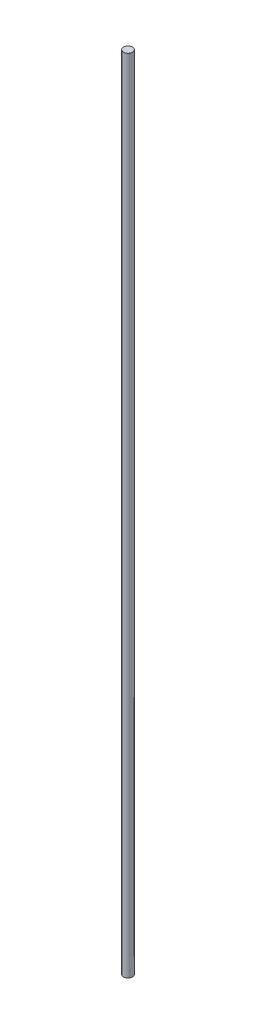
ISO-10303-21;
HEADER;
FILE_DESCRIPTION(('STEP AP214'),'2;1');
FILE_NAME('part.step','',(''),(''),'','','');
FILE_SCHEMA(('AUTOMOTIVE_DESIGN { 1 0 10303 214 1 1 1 1 }'));
ENDSEC;
DATA;
#1=APPLICATION_CONTEXT('core data for automotive mechanical design processes');
#2=APPLICATION_PROTOCOL_DEFINITION('international standard','automotive_design',2000,#1);
#3=PRODUCT_CONTEXT('',#1,'mechanical');
#4=PRODUCT('Part','Part','',(#3));
#5=PRODUCT_RELATED_PRODUCT_CATEGORY('part','',(#4));
#6=PRODUCT_DEFINITION_FORMATION('','',#4);
#7=PRODUCT_DEFINITION_CONTEXT('part definition',#1,'design');
#8=PRODUCT_DEFINITION('design','',#6,#7);
#9=PRODUCT_DEFINITION_SHAPE('','',#8);
#10=(LENGTH_UNIT() NAMED_UNIT(*) SI_UNIT(.MILLI.,.METRE.));
#11=(NAMED_UNIT(*) PLANE_ANGLE_UNIT() SI_UNIT($,.RADIAN.));
#12=(NAMED_UNIT(*) SI_UNIT($,.STERADIAN.) SOLID_ANGLE_UNIT());
#13=UNCERTAINTY_MEASURE_WITH_UNIT(LENGTH_MEASURE(1.E-05),#10,'distance_accuracy_value','');
#14=(GEOMETRIC_REPRESENTATION_CONTEXT(3) GLOBAL_UNCERTAINTY_ASSIGNED_CONTEXT((#13)) GLOBAL_UNIT_ASSIGNED_CONTEXT((#10,
#11,#12)) REPRESENTATION_CONTEXT('',''));
#15=CARTESIAN_POINT('',(0.,0.,0.));
#16=DIRECTION('',(0.,0.,1.));
#17=DIRECTION('',(1.,0.,0.));
#18=AXIS2_PLACEMENT_3D('',#15,#16,#17);
#19=CARTESIAN_POINT('',(0.,38.1,0.));
#20=DIRECTION('',(0.,-1.,0.));
#21=DIRECTION('',(0.,0.,-1.));
#22=AXIS2_PLACEMENT_3D('',#19,#20,#21);
#23=CYLINDRICAL_SURFACE('',#22,0.2125);
#24=CARTESIAN_POINT('',(0.,38.1,0.));
#25=DIRECTION('',(0.,1.,0.));
#26=DIRECTION('',(0.,0.,1.));
#27=AXIS2_PLACEMENT_3D('',#24,#25,#26);
#28=CIRCLE('',#27,0.2125);
#29=CARTESIAN_POINT('',(0.,38.1,0.2125));
#30=VERTEX_POINT('',#29);
#31=EDGE_CURVE('E10',#30,#30,#28,.T.);
#32=ORIENTED_EDGE('',*,*,#31,.F.);
#33=EDGE_LOOP('',(#32));
#34=FACE_BOUND('',#33,.T.);
#35=CARTESIAN_POINT('',(0.,0.,0.));
#36=DIRECTION('',(0.,1.,0.));
#37=DIRECTION('',(0.,0.,1.));
#38=AXIS2_PLACEMENT_3D('',#35,#36,#37);
#39=CIRCLE('',#38,0.2125);
#40=CARTESIAN_POINT('',(0.,0.,0.2125));
#41=VERTEX_POINT('',#40);
#42=EDGE_CURVE('E34',#41,#41,#39,.T.);
#43=ORIENTED_EDGE('',*,*,#42,.T.);
#44=EDGE_LOOP('',(#43));
#45=FACE_BOUND('',#44,.T.);
#46=ADVANCED_FACE('F31',(#34,#45),#23,.T.);
#47=CARTESIAN_POINT('',(0.,38.1,0.));
#48=DIRECTION('',(0.,1.,0.));
#49=DIRECTION('',(0.,0.,1.));
#50=AXIS2_PLACEMENT_3D('',#47,#48,#49);
#51=PLANE('',#50);
#52=ORIENTED_EDGE('',*,*,#31,.T.);
#53=EDGE_LOOP('',(#52));
#54=FACE_BOUND('',#53,.T.);
#55=ADVANCED_FACE('F46',(#54),#51,.T.);
#56=CARTESIAN_POINT('',(0.,0.,0.));
#57=DIRECTION('',(0.,1.,0.));
#58=DIRECTION('',(0.,0.,1.));
#59=AXIS2_PLACEMENT_3D('',#56,#57,#58);
#60=PLANE('',#59);
#61=ORIENTED_EDGE('',*,*,#42,.F.);
#62=EDGE_LOOP('',(#61));
#63=FACE_BOUND('',#62,.T.);
#64=ADVANCED_FACE('F44',(#63),#60,.F.);
#65=CLOSED_SHELL('',(#46,#55,#64));
#66=MANIFOLD_SOLID_BREP('B2',#65);
#67=ADVANCED_BREP_SHAPE_REPRESENTATION('',(#18,#66),#14);
#68=SHAPE_DEFINITION_REPRESENTATION(#9,#67);
ENDSEC;
END-ISO-10303-21;
